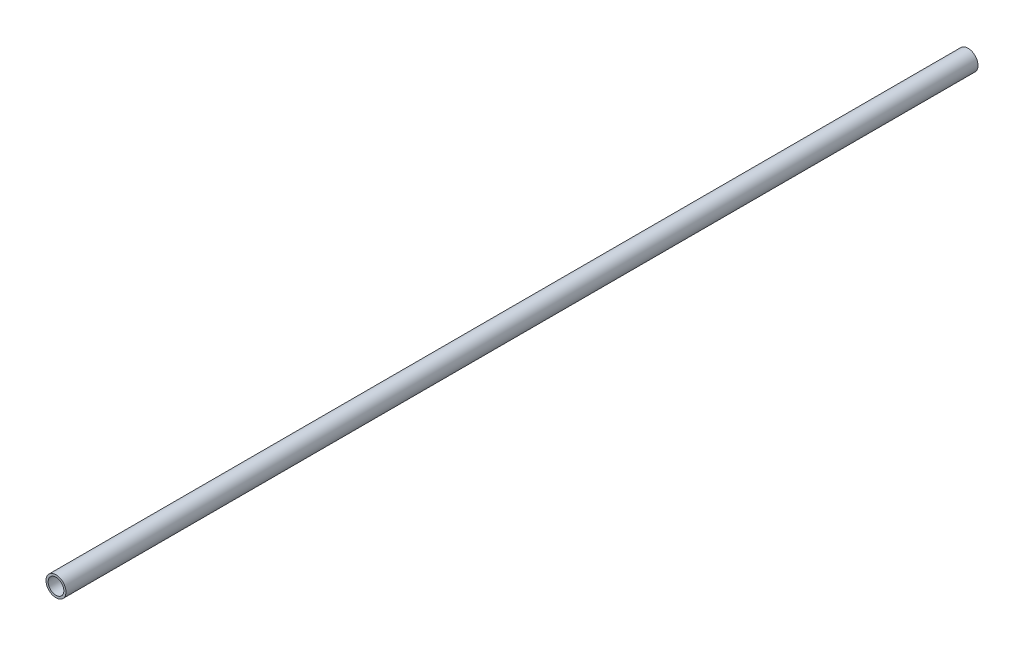
ISO-10303-21;
HEADER;
FILE_DESCRIPTION(('STEP AP214'),'2;1');
FILE_NAME('part.step','',(''),(''),'','','');
FILE_SCHEMA(('AUTOMOTIVE_DESIGN { 1 0 10303 214 1 1 1 1 }'));
ENDSEC;
DATA;
#1=APPLICATION_CONTEXT('core data for automotive mechanical design processes');
#2=APPLICATION_PROTOCOL_DEFINITION('international standard','automotive_design',2000,#1);
#3=PRODUCT_CONTEXT('',#1,'mechanical');
#4=PRODUCT('Part','Part','',(#3));
#5=PRODUCT_RELATED_PRODUCT_CATEGORY('part','',(#4));
#6=PRODUCT_DEFINITION_FORMATION('','',#4);
#7=PRODUCT_DEFINITION_CONTEXT('part definition',#1,'design');
#8=PRODUCT_DEFINITION('design','',#6,#7);
#9=PRODUCT_DEFINITION_SHAPE('','',#8);
#10=(LENGTH_UNIT() NAMED_UNIT(*) SI_UNIT(.MILLI.,.METRE.));
#11=(NAMED_UNIT(*) PLANE_ANGLE_UNIT() SI_UNIT($,.RADIAN.));
#12=(NAMED_UNIT(*) SI_UNIT($,.STERADIAN.) SOLID_ANGLE_UNIT());
#13=UNCERTAINTY_MEASURE_WITH_UNIT(LENGTH_MEASURE(1.E-05),#10,'distance_accuracy_value','');
#14=(GEOMETRIC_REPRESENTATION_CONTEXT(3) GLOBAL_UNCERTAINTY_ASSIGNED_CONTEXT((#13)) GLOBAL_UNIT_ASSIGNED_CONTEXT((#10,
#11,#12)) REPRESENTATION_CONTEXT('',''));
#15=CARTESIAN_POINT('',(0.,0.,0.));
#16=DIRECTION('',(0.,0.,1.));
#17=DIRECTION('',(1.,0.,0.));
#18=AXIS2_PLACEMENT_3D('',#15,#16,#17);
#19=CARTESIAN_POINT('',(0.,0.,762.));
#20=DIRECTION('',(0.,0.,-1.));
#21=DIRECTION('',(-1.,0.,0.));
#22=AXIS2_PLACEMENT_3D('',#19,#20,#21);
#23=CYLINDRICAL_SURFACE('',#22,13.335);
#24=CARTESIAN_POINT('',(0.,0.,-762.));
#25=DIRECTION('',(0.,0.,1.));
#26=DIRECTION('',(1.,0.,0.));
#27=AXIS2_PLACEMENT_3D('',#24,#25,#26);
#28=CIRCLE('',#27,13.335);
#29=CARTESIAN_POINT('',(13.335,0.,-762.));
#30=VERTEX_POINT('',#29);
#31=EDGE_CURVE('E11',#30,#30,#28,.T.);
#32=ORIENTED_EDGE('',*,*,#31,.T.);
#33=EDGE_LOOP('',(#32));
#34=FACE_BOUND('',#33,.T.);
#35=CARTESIAN_POINT('',(0.,0.,454.64333125));
#36=DIRECTION('',(0.,0.,1.));
#37=DIRECTION('',(1.,0.,0.));
#38=AXIS2_PLACEMENT_3D('',#35,#36,#37);
#39=CIRCLE('',#38,13.335);
#40=CARTESIAN_POINT('',(13.335,0.,454.64333125));
#41=VERTEX_POINT('',#40);
#42=EDGE_CURVE('E60',#41,#41,#39,.F.);
#43=ORIENTED_EDGE('',*,*,#42,.T.);
#44=EDGE_LOOP('',(#43));
#45=FACE_BOUND('',#44,.T.);
#46=ADVANCED_FACE('F43',(#34,#45),#23,.T.);
#47=CARTESIAN_POINT('',(0.,0.,762.));
#48=DIRECTION('',(0.,0.,-1.));
#49=DIRECTION('',(-1.,0.,0.));
#50=AXIS2_PLACEMENT_3D('',#47,#48,#49);
#51=CYLINDRICAL_SURFACE('',#50,10.4648);
#52=CARTESIAN_POINT('',(0.,0.,-762.));
#53=DIRECTION('',(0.,0.,1.));
#54=DIRECTION('',(1.,0.,0.));
#55=AXIS2_PLACEMENT_3D('',#52,#53,#54);
#56=CIRCLE('',#55,10.4648);
#57=CARTESIAN_POINT('',(10.4648,0.,-762.));
#58=VERTEX_POINT('',#57);
#59=EDGE_CURVE('E50',#58,#58,#56,.T.);
#60=ORIENTED_EDGE('',*,*,#59,.F.);
#61=EDGE_LOOP('',(#60));
#62=FACE_BOUND('',#61,.T.);
#63=CARTESIAN_POINT('',(0.,0.,454.64333125));
#64=DIRECTION('',(0.,0.,1.));
#65=DIRECTION('',(1.,0.,0.));
#66=AXIS2_PLACEMENT_3D('',#63,#64,#65);
#67=CIRCLE('',#66,10.4648);
#68=CARTESIAN_POINT('',(10.4648,0.,454.64333125));
#69=VERTEX_POINT('',#68);
#70=EDGE_CURVE('E55',#69,#69,#67,.F.);
#71=ORIENTED_EDGE('',*,*,#70,.F.);
#72=EDGE_LOOP('',(#71));
#73=FACE_BOUND('',#72,.T.);
#74=ADVANCED_FACE('F75',(#62,#73),#51,.F.);
#75=CARTESIAN_POINT('',(0.,0.,-762.));
#76=DIRECTION('',(0.,0.,1.));
#77=DIRECTION('',(1.,0.,0.));
#78=AXIS2_PLACEMENT_3D('',#75,#76,#77);
#79=PLANE('',#78);
#80=ORIENTED_EDGE('',*,*,#59,.T.);
#81=EDGE_LOOP('',(#80));
#82=FACE_BOUND('',#81,.T.);
#83=ORIENTED_EDGE('',*,*,#31,.F.);
#84=EDGE_LOOP('',(#83));
#85=FACE_BOUND('',#84,.T.);
#86=ADVANCED_FACE('F71',(#82,#85),#79,.F.);
#87=CARTESIAN_POINT('',(0.,0.,454.64333125));
#88=DIRECTION('',(0.,0.,1.));
#89=DIRECTION('',(1.,0.,0.));
#90=AXIS2_PLACEMENT_3D('',#87,#88,#89);
#91=PLANE('',#90);
#92=ORIENTED_EDGE('',*,*,#42,.F.);
#93=EDGE_LOOP('',(#92));
#94=FACE_BOUND('',#93,.T.);
#95=ORIENTED_EDGE('',*,*,#70,.T.);
#96=EDGE_LOOP('',(#95));
#97=FACE_BOUND('',#96,.T.);
#98=ADVANCED_FACE('F68',(#94,#97),#91,.T.);
#99=CLOSED_SHELL('',(#46,#74,#86,#98));
#100=MANIFOLD_SOLID_BREP('B2',#99);
#101=ADVANCED_BREP_SHAPE_REPRESENTATION('',(#18,#100),#14);
#102=SHAPE_DEFINITION_REPRESENTATION(#9,#101);
ENDSEC;
END-ISO-10303-21;
